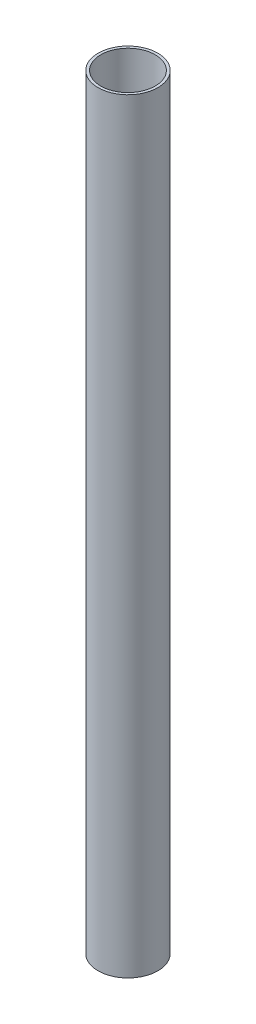
ISO-10303-21;
HEADER;
FILE_DESCRIPTION(('STEP AP214'),'2;1');
FILE_NAME('part.step','',(''),(''),'','','');
FILE_SCHEMA(('AUTOMOTIVE_DESIGN { 1 0 10303 214 1 1 1 1 }'));
ENDSEC;
DATA;
#1=APPLICATION_CONTEXT('core data for automotive mechanical design processes');
#2=APPLICATION_PROTOCOL_DEFINITION('international standard','automotive_design',2000,#1);
#3=PRODUCT_CONTEXT('',#1,'mechanical');
#4=PRODUCT('Part','Part','',(#3));
#5=PRODUCT_RELATED_PRODUCT_CATEGORY('part','',(#4));
#6=PRODUCT_DEFINITION_FORMATION('','',#4);
#7=PRODUCT_DEFINITION_CONTEXT('part definition',#1,'design');
#8=PRODUCT_DEFINITION('design','',#6,#7);
#9=PRODUCT_DEFINITION_SHAPE('','',#8);
#10=(LENGTH_UNIT() NAMED_UNIT(*) SI_UNIT(.MILLI.,.METRE.));
#11=(NAMED_UNIT(*) PLANE_ANGLE_UNIT() SI_UNIT($,.RADIAN.));
#12=(NAMED_UNIT(*) SI_UNIT($,.STERADIAN.) SOLID_ANGLE_UNIT());
#13=UNCERTAINTY_MEASURE_WITH_UNIT(LENGTH_MEASURE(1.E-05),#10,'distance_accuracy_value','');
#14=(GEOMETRIC_REPRESENTATION_CONTEXT(3) GLOBAL_UNCERTAINTY_ASSIGNED_CONTEXT((#13)) GLOBAL_UNIT_ASSIGNED_CONTEXT((#10,
#11,#12)) REPRESENTATION_CONTEXT('',''));
#15=CARTESIAN_POINT('',(0.,0.,0.));
#16=DIRECTION('',(0.,0.,1.));
#17=DIRECTION('',(1.,0.,0.));
#18=AXIS2_PLACEMENT_3D('',#15,#16,#17);
#19=CARTESIAN_POINT('',(0.,203.2,0.));
#20=DIRECTION('',(0.,1.,0.));
#21=DIRECTION('',(0.,0.,1.));
#22=AXIS2_PLACEMENT_3D('',#19,#20,#21);
#23=PLANE('',#22);
#24=CARTESIAN_POINT('',(0.,203.2,0.));
#25=DIRECTION('',(0.,1.,0.));
#26=DIRECTION('',(0.,0.,1.));
#27=AXIS2_PLACEMENT_3D('',#24,#25,#26);
#28=CIRCLE('',#27,7.9375);
#29=CARTESIAN_POINT('',(0.,203.2,7.9375));
#30=VERTEX_POINT('',#29);
#31=EDGE_CURVE('E10',#30,#30,#28,.T.);
#32=ORIENTED_EDGE('',*,*,#31,.T.);
#33=EDGE_LOOP('',(#32));
#34=FACE_BOUND('',#33,.T.);
#35=CARTESIAN_POINT('',(0.,203.2,0.));
#36=DIRECTION('',(0.,1.,0.));
#37=DIRECTION('',(0.,0.,1.));
#38=AXIS2_PLACEMENT_3D('',#35,#36,#37);
#39=CIRCLE('',#38,7.2263);
#40=CARTESIAN_POINT('',(0.,203.2,7.2263));
#41=VERTEX_POINT('',#40);
#42=EDGE_CURVE('E42',#41,#41,#39,.T.);
#43=ORIENTED_EDGE('',*,*,#42,.F.);
#44=EDGE_LOOP('',(#43));
#45=FACE_BOUND('',#44,.T.);
#46=ADVANCED_FACE('F31',(#34,#45),#23,.T.);
#47=CARTESIAN_POINT('',(0.,0.,0.));
#48=DIRECTION('',(0.,1.,0.));
#49=DIRECTION('',(0.,0.,1.));
#50=AXIS2_PLACEMENT_3D('',#47,#48,#49);
#51=PLANE('',#50);
#52=CARTESIAN_POINT('',(0.,0.,0.));
#53=DIRECTION('',(0.,1.,0.));
#54=DIRECTION('',(0.,0.,1.));
#55=AXIS2_PLACEMENT_3D('',#52,#53,#54);
#56=CIRCLE('',#55,7.9375);
#57=CARTESIAN_POINT('',(0.,0.,7.9375));
#58=VERTEX_POINT('',#57);
#59=EDGE_CURVE('E35',#58,#58,#56,.T.);
#60=ORIENTED_EDGE('',*,*,#59,.F.);
#61=EDGE_LOOP('',(#60));
#62=FACE_BOUND('',#61,.T.);
#63=CARTESIAN_POINT('',(0.,0.,0.));
#64=DIRECTION('',(0.,1.,0.));
#65=DIRECTION('',(0.,0.,1.));
#66=AXIS2_PLACEMENT_3D('',#63,#64,#65);
#67=CIRCLE('',#66,7.2263);
#68=CARTESIAN_POINT('',(0.,0.,7.2263));
#69=VERTEX_POINT('',#68);
#70=EDGE_CURVE('E44',#69,#69,#67,.T.);
#71=ORIENTED_EDGE('',*,*,#70,.T.);
#72=EDGE_LOOP('',(#71));
#73=FACE_BOUND('',#72,.T.);
#74=ADVANCED_FACE('F54',(#62,#73),#51,.F.);
#75=CARTESIAN_POINT('',(0.,203.2,0.));
#76=DIRECTION('',(0.,-1.,0.));
#77=DIRECTION('',(0.,0.,-1.));
#78=AXIS2_PLACEMENT_3D('',#75,#76,#77);
#79=CYLINDRICAL_SURFACE('',#78,7.9375);
#80=ORIENTED_EDGE('',*,*,#31,.F.);
#81=EDGE_LOOP('',(#80));
#82=FACE_BOUND('',#81,.T.);
#83=ORIENTED_EDGE('',*,*,#59,.T.);
#84=EDGE_LOOP('',(#83));
#85=FACE_BOUND('',#84,.T.);
#86=ADVANCED_FACE('F33',(#82,#85),#79,.T.);
#87=CARTESIAN_POINT('',(0.,203.2,0.));
#88=DIRECTION('',(0.,-1.,0.));
#89=DIRECTION('',(0.,0.,-1.));
#90=AXIS2_PLACEMENT_3D('',#87,#88,#89);
#91=CYLINDRICAL_SURFACE('',#90,7.2263);
#92=ORIENTED_EDGE('',*,*,#42,.T.);
#93=EDGE_LOOP('',(#92));
#94=FACE_BOUND('',#93,.T.);
#95=ORIENTED_EDGE('',*,*,#70,.F.);
#96=EDGE_LOOP('',(#95));
#97=FACE_BOUND('',#96,.T.);
#98=ADVANCED_FACE('F50',(#94,#97),#91,.F.);
#99=CLOSED_SHELL('',(#46,#74,#86,#98));
#100=MANIFOLD_SOLID_BREP('B2',#99);
#101=ADVANCED_BREP_SHAPE_REPRESENTATION('',(#18,#100),#14);
#102=SHAPE_DEFINITION_REPRESENTATION(#9,#101);
ENDSEC;
END-ISO-10303-21;
